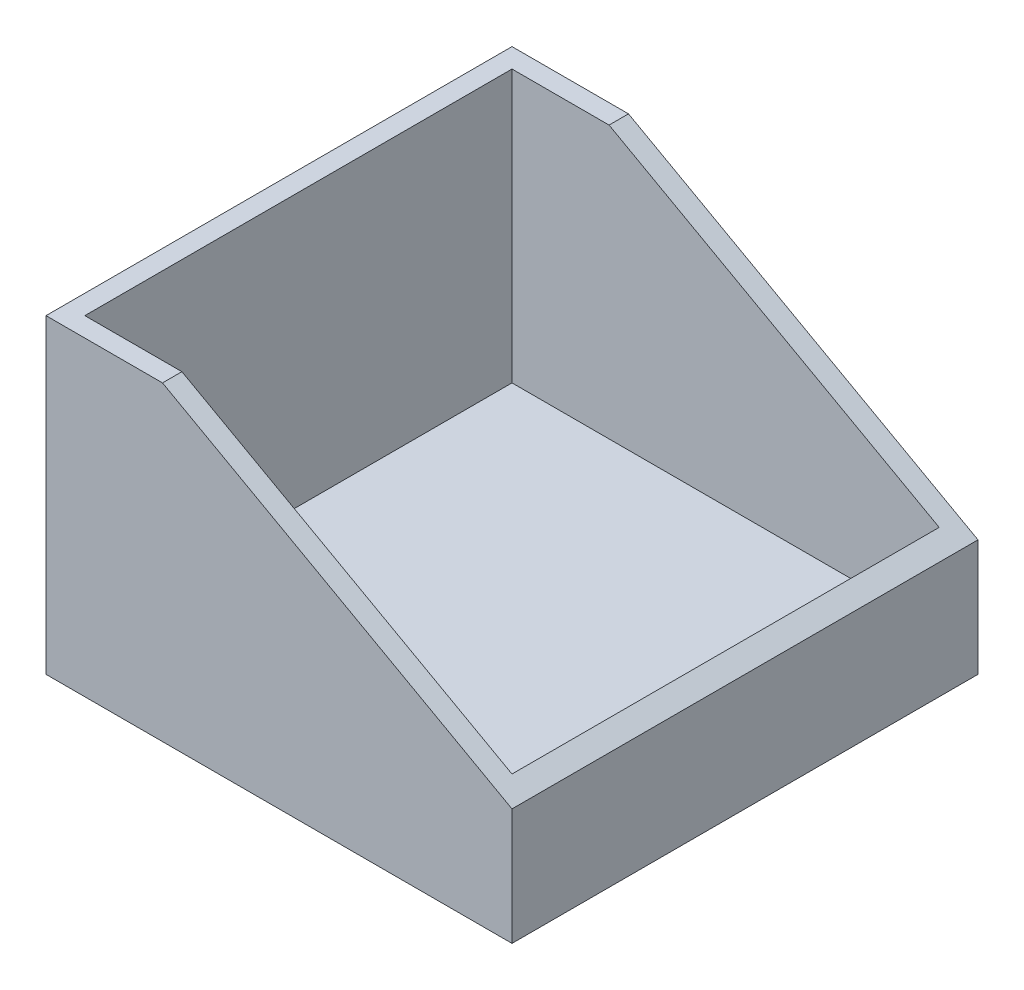
ISO-10303-21;
HEADER;
FILE_DESCRIPTION(('STEP AP214'),'2;1');
FILE_NAME('part.step','',(''),(''),'','','');
FILE_SCHEMA(('AUTOMOTIVE_DESIGN { 1 0 10303 214 1 1 1 1 }'));
ENDSEC;
DATA;
#1=APPLICATION_CONTEXT('core data for automotive mechanical design processes');
#2=APPLICATION_PROTOCOL_DEFINITION('international standard','automotive_design',2000,#1);
#3=PRODUCT_CONTEXT('',#1,'mechanical');
#4=PRODUCT('Part','Part','',(#3));
#5=PRODUCT_RELATED_PRODUCT_CATEGORY('part','',(#4));
#6=PRODUCT_DEFINITION_FORMATION('','',#4);
#7=PRODUCT_DEFINITION_CONTEXT('part definition',#1,'design');
#8=PRODUCT_DEFINITION('design','',#6,#7);
#9=PRODUCT_DEFINITION_SHAPE('','',#8);
#10=(LENGTH_UNIT() NAMED_UNIT(*) SI_UNIT(.MILLI.,.METRE.));
#11=(NAMED_UNIT(*) PLANE_ANGLE_UNIT() SI_UNIT($,.RADIAN.));
#12=(NAMED_UNIT(*) SI_UNIT($,.STERADIAN.) SOLID_ANGLE_UNIT());
#13=UNCERTAINTY_MEASURE_WITH_UNIT(LENGTH_MEASURE(1.E-05),#10,'distance_accuracy_value','');
#14=(GEOMETRIC_REPRESENTATION_CONTEXT(3) GLOBAL_UNCERTAINTY_ASSIGNED_CONTEXT((#13)) GLOBAL_UNIT_ASSIGNED_CONTEXT((#10,
#11,#12)) REPRESENTATION_CONTEXT('',''));
#15=CARTESIAN_POINT('',(0.,0.,0.));
#16=DIRECTION('',(0.,0.,1.));
#17=DIRECTION('',(1.,0.,0.));
#18=AXIS2_PLACEMENT_3D('',#15,#16,#17);
#19=CARTESIAN_POINT('',(152.4,101.6,152.4));
#20=DIRECTION('',(-1.,0.,0.));
#21=DIRECTION('',(0.,0.,1.));
#22=AXIS2_PLACEMENT_3D('',#19,#20,#21);
#23=PLANE('',#22);
#24=DIRECTION('',(0.,0.,1.));
#25=VECTOR('',#24,1.);
#26=CARTESIAN_POINT('',(152.4,38.1,0.));
#27=LINE('',#26,#25);
#28=CARTESIAN_POINT('',(152.4,38.1,0.));
#29=VERTEX_POINT('',#28);
#30=CARTESIAN_POINT('',(152.4,38.1,152.4));
#31=VERTEX_POINT('',#30);
#32=EDGE_CURVE('E56',#29,#31,#27,.T.);
#33=ORIENTED_EDGE('',*,*,#32,.T.);
#34=DIRECTION('',(0.,1.,0.));
#35=VECTOR('',#34,1.);
#36=CARTESIAN_POINT('',(152.4,101.6,152.4));
#37=LINE('',#36,#35);
#38=CARTESIAN_POINT('',(152.4,0.,152.4));
#39=VERTEX_POINT('',#38);
#40=EDGE_CURVE('E162',#39,#31,#37,.T.);
#41=ORIENTED_EDGE('',*,*,#40,.F.);
#42=DIRECTION('',(0.,0.,-1.));
#43=VECTOR('',#42,1.);
#44=CARTESIAN_POINT('',(152.4,0.,152.4));
#45=LINE('',#44,#43);
#46=CARTESIAN_POINT('',(152.4,0.,0.));
#47=VERTEX_POINT('',#46);
#48=EDGE_CURVE('E184',#39,#47,#45,.T.);
#49=ORIENTED_EDGE('',*,*,#48,.T.);
#50=DIRECTION('',(0.,1.,0.));
#51=VECTOR('',#50,1.);
#52=CARTESIAN_POINT('',(152.4,101.6,0.));
#53=LINE('',#52,#51);
#54=EDGE_CURVE('E173',#47,#29,#53,.T.);
#55=ORIENTED_EDGE('',*,*,#54,.T.);
#56=EDGE_LOOP('',(#33,#41,#49,#55));
#57=FACE_BOUND('',#56,.T.);
#58=ADVANCED_FACE('F33',(#57),#23,.F.);
#59=CARTESIAN_POINT('',(0.,101.6,152.4));
#60=DIRECTION('',(0.,-1.,0.));
#61=DIRECTION('',(0.,0.,-1.));
#62=AXIS2_PLACEMENT_3D('',#59,#60,#61);
#63=PLANE('',#62);
#64=DIRECTION('',(0.,0.,1.));
#65=VECTOR('',#64,1.);
#66=CARTESIAN_POINT('',(6.34999999999999,101.6,6.35000000000002));
#67=LINE('',#66,#65);
#68=CARTESIAN_POINT('',(6.34999999999999,101.6,6.35000000000002));
#69=VERTEX_POINT('',#68);
#70=CARTESIAN_POINT('',(6.35000000000002,101.6,146.05));
#71=VERTEX_POINT('',#70);
#72=EDGE_CURVE('E135',#69,#71,#67,.T.);
#73=ORIENTED_EDGE('',*,*,#72,.F.);
#74=DIRECTION('',(-1.,0.,0.));
#75=VECTOR('',#74,1.);
#76=CARTESIAN_POINT('',(146.05,101.6,6.35));
#77=LINE('',#76,#75);
#78=CARTESIAN_POINT('',(38.1000000000001,101.6,6.35000000000001));
#79=VERTEX_POINT('',#78);
#80=EDGE_CURVE('E117',#79,#69,#77,.T.);
#81=ORIENTED_EDGE('',*,*,#80,.F.);
#82=DIRECTION('',(0.,0.,1.));
#83=VECTOR('',#82,1.);
#84=CARTESIAN_POINT('',(38.1,101.6,0.));
#85=LINE('',#84,#83);
#86=CARTESIAN_POINT('',(38.1,101.6,0.));
#87=VERTEX_POINT('',#86);
#88=EDGE_CURVE('E153',#87,#79,#85,.T.);
#89=ORIENTED_EDGE('',*,*,#88,.F.);
#90=DIRECTION('',(-1.,0.,0.));
#91=VECTOR('',#90,1.);
#92=CARTESIAN_POINT('',(0.,101.6,0.));
#93=LINE('',#92,#91);
#94=CARTESIAN_POINT('',(0.,101.6,0.));
#95=VERTEX_POINT('',#94);
#96=EDGE_CURVE('E176',#87,#95,#93,.T.);
#97=ORIENTED_EDGE('',*,*,#96,.T.);
#98=DIRECTION('',(0.,0.,-1.));
#99=VECTOR('',#98,1.);
#100=CARTESIAN_POINT('',(0.,101.6,152.4));
#101=LINE('',#100,#99);
#102=CARTESIAN_POINT('',(0.,101.6,152.4));
#103=VERTEX_POINT('',#102);
#104=EDGE_CURVE('E181',#103,#95,#101,.T.);
#105=ORIENTED_EDGE('',*,*,#104,.F.);
#106=DIRECTION('',(-1.,0.,0.));
#107=VECTOR('',#106,1.);
#108=CARTESIAN_POINT('',(0.,101.6,152.4));
#109=LINE('',#108,#107);
#110=CARTESIAN_POINT('',(38.1,101.6,152.4));
#111=VERTEX_POINT('',#110);
#112=EDGE_CURVE('E166',#111,#103,#109,.T.);
#113=ORIENTED_EDGE('',*,*,#112,.F.);
#114=CARTESIAN_POINT('',(38.1,101.6,146.05));
#115=VERTEX_POINT('',#114);
#116=EDGE_CURVE('E157',#115,#111,#85,.T.);
#117=ORIENTED_EDGE('',*,*,#116,.F.);
#118=DIRECTION('',(1.,0.,0.));
#119=VECTOR('',#118,1.);
#120=CARTESIAN_POINT('',(6.35000000000002,101.6,146.05));
#121=LINE('',#120,#119);
#122=EDGE_CURVE('E48',#71,#115,#121,.T.);
#123=ORIENTED_EDGE('',*,*,#122,.F.);
#124=EDGE_LOOP('',(#73,#81,#89,#97,#105,#113,#117,#123));
#125=FACE_BOUND('',#124,.T.);
#126=ADVANCED_FACE('F196',(#125),#63,.F.);
#127=CARTESIAN_POINT('',(0.,0.,152.4));
#128=DIRECTION('',(0.,0.,-1.));
#129=DIRECTION('',(-1.,0.,0.));
#130=AXIS2_PLACEMENT_3D('',#127,#128,#129);
#131=PLANE('',#130);
#132=DIRECTION('',(-0.874157276121538,0.485642931178632,0.));
#133=VECTOR('',#132,1.);
#134=CARTESIAN_POINT('',(52.1179245283019,93.8122641509434,152.4));
#135=LINE('',#134,#133);
#136=EDGE_CURVE('E144',#31,#111,#135,.T.);
#137=ORIENTED_EDGE('',*,*,#136,.T.);
#138=ORIENTED_EDGE('',*,*,#112,.T.);
#139=DIRECTION('',(0.,-1.,0.));
#140=VECTOR('',#139,1.);
#141=CARTESIAN_POINT('',(0.,0.,152.4));
#142=LINE('',#141,#140);
#143=CARTESIAN_POINT('',(0.,0.,152.4));
#144=VERTEX_POINT('',#143);
#145=EDGE_CURVE('E168',#103,#144,#142,.T.);
#146=ORIENTED_EDGE('',*,*,#145,.T.);
#147=DIRECTION('',(1.,0.,0.));
#148=VECTOR('',#147,1.);
#149=CARTESIAN_POINT('',(152.4,0.,152.4));
#150=LINE('',#149,#148);
#151=EDGE_CURVE('E159',#144,#39,#150,.T.);
#152=ORIENTED_EDGE('',*,*,#151,.T.);
#153=ORIENTED_EDGE('',*,*,#40,.T.);
#154=EDGE_LOOP('',(#137,#138,#146,#152,#153));
#155=FACE_BOUND('',#154,.T.);
#156=ADVANCED_FACE('F210',(#155),#131,.F.);
#157=CARTESIAN_POINT('',(0.,0.,0.));
#158=DIRECTION('',(0.,0.,-1.));
#159=DIRECTION('',(-1.,0.,0.));
#160=AXIS2_PLACEMENT_3D('',#157,#158,#159);
#161=PLANE('',#160);
#162=ORIENTED_EDGE('',*,*,#96,.F.);
#163=DIRECTION('',(-0.874157276121538,0.485642931178632,0.));
#164=VECTOR('',#163,1.);
#165=CARTESIAN_POINT('',(52.1179245283019,93.8122641509434,0.));
#166=LINE('',#165,#164);
#167=EDGE_CURVE('E149',#29,#87,#166,.T.);
#168=ORIENTED_EDGE('',*,*,#167,.F.);
#169=ORIENTED_EDGE('',*,*,#54,.F.);
#170=DIRECTION('',(1.,0.,0.));
#171=VECTOR('',#170,1.);
#172=CARTESIAN_POINT('',(152.4,0.,0.));
#173=LINE('',#172,#171);
#174=CARTESIAN_POINT('',(0.,0.,0.));
#175=VERTEX_POINT('',#174);
#176=EDGE_CURVE('E156',#175,#47,#173,.T.);
#177=ORIENTED_EDGE('',*,*,#176,.F.);
#178=DIRECTION('',(0.,-1.,0.));
#179=VECTOR('',#178,1.);
#180=CARTESIAN_POINT('',(0.,0.,0.));
#181=LINE('',#180,#179);
#182=EDGE_CURVE('E163',#95,#175,#181,.T.);
#183=ORIENTED_EDGE('',*,*,#182,.F.);
#184=EDGE_LOOP('',(#162,#168,#169,#177,#183));
#185=FACE_BOUND('',#184,.T.);
#186=ADVANCED_FACE('F200',(#185),#161,.T.);
#187=CARTESIAN_POINT('',(152.4,0.,152.4));
#188=DIRECTION('',(0.,1.,0.));
#189=DIRECTION('',(-1.,0.,0.));
#190=AXIS2_PLACEMENT_3D('',#187,#188,#189);
#191=PLANE('',#190);
#192=ORIENTED_EDGE('',*,*,#176,.T.);
#193=ORIENTED_EDGE('',*,*,#48,.F.);
#194=ORIENTED_EDGE('',*,*,#151,.F.);
#195=DIRECTION('',(0.,0.,-1.));
#196=VECTOR('',#195,1.);
#197=CARTESIAN_POINT('',(0.,0.,152.4));
#198=LINE('',#197,#196);
#199=EDGE_CURVE('E170',#144,#175,#198,.T.);
#200=ORIENTED_EDGE('',*,*,#199,.T.);
#201=EDGE_LOOP('',(#192,#193,#194,#200));
#202=FACE_BOUND('',#201,.T.);
#203=ADVANCED_FACE('F35',(#202),#191,.F.);
#204=CARTESIAN_POINT('',(0.,0.,152.4));
#205=DIRECTION('',(1.,0.,0.));
#206=DIRECTION('',(0.,0.,-1.));
#207=AXIS2_PLACEMENT_3D('',#204,#205,#206);
#208=PLANE('',#207);
#209=ORIENTED_EDGE('',*,*,#182,.T.);
#210=ORIENTED_EDGE('',*,*,#199,.F.);
#211=ORIENTED_EDGE('',*,*,#145,.F.);
#212=ORIENTED_EDGE('',*,*,#104,.T.);
#213=EDGE_LOOP('',(#209,#210,#211,#212));
#214=FACE_BOUND('',#213,.T.);
#215=ADVANCED_FACE('F204',(#214),#208,.F.);
#216=CARTESIAN_POINT('',(52.1179245283019,93.8122641509434,0.));
#217=DIRECTION('',(0.485642931178632,0.874157276121538,0.));
#218=DIRECTION('',(-0.874157276121538,0.485642931178632,0.));
#219=AXIS2_PLACEMENT_3D('',#216,#217,#218);
#220=PLANE('',#219);
#221=DIRECTION('',(-0.874157276121538,0.485642931178632,0.));
#222=VECTOR('',#221,1.);
#223=CARTESIAN_POINT('',(52.1179245283019,93.8122641509434,6.35000000000001));
#224=LINE('',#223,#222);
#225=CARTESIAN_POINT('',(146.05,41.6277777777778,6.35));
#226=VERTEX_POINT('',#225);
#227=EDGE_CURVE('E11',#226,#79,#224,.T.);
#228=ORIENTED_EDGE('',*,*,#227,.F.);
#229=DIRECTION('',(0.,0.,-1.));
#230=VECTOR('',#229,1.);
#231=CARTESIAN_POINT('',(146.05,41.6277777777778,0.));
#232=LINE('',#231,#230);
#233=CARTESIAN_POINT('',(146.05,41.6277777777778,146.05));
#234=VERTEX_POINT('',#233);
#235=EDGE_CURVE('E41',#234,#226,#232,.T.);
#236=ORIENTED_EDGE('',*,*,#235,.F.);
#237=DIRECTION('',(0.874157276121538,-0.485642931178632,0.));
#238=VECTOR('',#237,1.);
#239=CARTESIAN_POINT('',(52.1179245283019,93.8122641509434,146.05));
#240=LINE('',#239,#238);
#241=EDGE_CURVE('E187',#115,#234,#240,.T.);
#242=ORIENTED_EDGE('',*,*,#241,.F.);
#243=ORIENTED_EDGE('',*,*,#116,.T.);
#244=ORIENTED_EDGE('',*,*,#136,.F.);
#245=ORIENTED_EDGE('',*,*,#32,.F.);
#246=ORIENTED_EDGE('',*,*,#167,.T.);
#247=ORIENTED_EDGE('',*,*,#88,.T.);
#248=EDGE_LOOP('',(#228,#236,#242,#243,#244,#245,#246,#247));
#249=FACE_BOUND('',#248,.T.);
#250=ADVANCED_FACE('F192',(#249),#220,.T.);
#251=CARTESIAN_POINT('',(146.05,12.7,6.35));
#252=DIRECTION('',(0.,0.,-1.));
#253=DIRECTION('',(-1.,0.,0.));
#254=AXIS2_PLACEMENT_3D('',#251,#252,#253);
#255=PLANE('',#254);
#256=ORIENTED_EDGE('',*,*,#227,.T.);
#257=ORIENTED_EDGE('',*,*,#80,.T.);
#258=DIRECTION('',(0.,1.,0.));
#259=VECTOR('',#258,1.);
#260=CARTESIAN_POINT('',(6.34999999999999,12.7,6.35000000000002));
#261=LINE('',#260,#259);
#262=CARTESIAN_POINT('',(6.34999999999999,12.7,6.35000000000002));
#263=VERTEX_POINT('',#262);
#264=EDGE_CURVE('E109',#263,#69,#261,.T.);
#265=ORIENTED_EDGE('',*,*,#264,.F.);
#266=DIRECTION('',(-1.,0.,0.));
#267=VECTOR('',#266,1.);
#268=CARTESIAN_POINT('',(146.05,12.7,6.35));
#269=LINE('',#268,#267);
#270=CARTESIAN_POINT('',(146.05,12.7,6.35));
#271=VERTEX_POINT('',#270);
#272=EDGE_CURVE('E114',#271,#263,#269,.T.);
#273=ORIENTED_EDGE('',*,*,#272,.F.);
#274=DIRECTION('',(0.,1.,0.));
#275=VECTOR('',#274,1.);
#276=CARTESIAN_POINT('',(146.05,12.7,6.35));
#277=LINE('',#276,#275);
#278=EDGE_CURVE('E142',#271,#226,#277,.T.);
#279=ORIENTED_EDGE('',*,*,#278,.T.);
#280=EDGE_LOOP('',(#256,#257,#265,#273,#279));
#281=FACE_BOUND('',#280,.T.);
#282=ADVANCED_FACE('F111',(#281),#255,.F.);
#283=CARTESIAN_POINT('',(146.05,12.7,146.05));
#284=DIRECTION('',(1.,0.,0.));
#285=DIRECTION('',(0.,0.,-1.));
#286=AXIS2_PLACEMENT_3D('',#283,#284,#285);
#287=PLANE('',#286);
#288=ORIENTED_EDGE('',*,*,#235,.T.);
#289=ORIENTED_EDGE('',*,*,#278,.F.);
#290=DIRECTION('',(0.,0.,-1.));
#291=VECTOR('',#290,1.);
#292=CARTESIAN_POINT('',(146.05,12.7,146.05));
#293=LINE('',#292,#291);
#294=CARTESIAN_POINT('',(146.05,12.7,146.05));
#295=VERTEX_POINT('',#294);
#296=EDGE_CURVE('E122',#295,#271,#293,.T.);
#297=ORIENTED_EDGE('',*,*,#296,.F.);
#298=DIRECTION('',(0.,1.,0.));
#299=VECTOR('',#298,1.);
#300=CARTESIAN_POINT('',(146.05,12.7,146.05));
#301=LINE('',#300,#299);
#302=EDGE_CURVE('E145',#295,#234,#301,.T.);
#303=ORIENTED_EDGE('',*,*,#302,.T.);
#304=EDGE_LOOP('',(#288,#289,#297,#303));
#305=FACE_BOUND('',#304,.T.);
#306=ADVANCED_FACE('F190',(#305),#287,.F.);
#307=CARTESIAN_POINT('',(6.35000000000002,12.7,146.05));
#308=DIRECTION('',(0.,0.,1.));
#309=DIRECTION('',(1.,0.,0.));
#310=AXIS2_PLACEMENT_3D('',#307,#308,#309);
#311=PLANE('',#310);
#312=ORIENTED_EDGE('',*,*,#241,.T.);
#313=ORIENTED_EDGE('',*,*,#302,.F.);
#314=DIRECTION('',(1.,0.,0.));
#315=VECTOR('',#314,1.);
#316=CARTESIAN_POINT('',(6.35000000000002,12.7,146.05));
#317=LINE('',#316,#315);
#318=CARTESIAN_POINT('',(6.35000000000002,12.7,146.05));
#319=VERTEX_POINT('',#318);
#320=EDGE_CURVE('E130',#319,#295,#317,.T.);
#321=ORIENTED_EDGE('',*,*,#320,.F.);
#322=DIRECTION('',(0.,1.,0.));
#323=VECTOR('',#322,1.);
#324=CARTESIAN_POINT('',(6.35000000000002,12.7,146.05));
#325=LINE('',#324,#323);
#326=EDGE_CURVE('E121',#319,#71,#325,.T.);
#327=ORIENTED_EDGE('',*,*,#326,.T.);
#328=ORIENTED_EDGE('',*,*,#122,.T.);
#329=EDGE_LOOP('',(#312,#313,#321,#327,#328));
#330=FACE_BOUND('',#329,.T.);
#331=ADVANCED_FACE('F213',(#330),#311,.F.);
#332=CARTESIAN_POINT('',(6.34999999999999,12.7,6.35000000000002));
#333=DIRECTION('',(-1.,0.,0.));
#334=DIRECTION('',(0.,0.,1.));
#335=AXIS2_PLACEMENT_3D('',#332,#333,#334);
#336=PLANE('',#335);
#337=ORIENTED_EDGE('',*,*,#72,.T.);
#338=ORIENTED_EDGE('',*,*,#326,.F.);
#339=DIRECTION('',(0.,0.,1.));
#340=VECTOR('',#339,1.);
#341=CARTESIAN_POINT('',(6.34999999999999,12.7,6.35000000000002));
#342=LINE('',#341,#340);
#343=EDGE_CURVE('E125',#263,#319,#342,.T.);
#344=ORIENTED_EDGE('',*,*,#343,.F.);
#345=ORIENTED_EDGE('',*,*,#264,.T.);
#346=EDGE_LOOP('',(#337,#338,#344,#345));
#347=FACE_BOUND('',#346,.T.);
#348=ADVANCED_FACE('F126',(#347),#336,.F.);
#349=CARTESIAN_POINT('',(0.,12.7,0.));
#350=DIRECTION('',(0.,1.,0.));
#351=DIRECTION('',(0.,0.,1.));
#352=AXIS2_PLACEMENT_3D('',#349,#350,#351);
#353=PLANE('',#352);
#354=ORIENTED_EDGE('',*,*,#272,.T.);
#355=ORIENTED_EDGE('',*,*,#343,.T.);
#356=ORIENTED_EDGE('',*,*,#320,.T.);
#357=ORIENTED_EDGE('',*,*,#296,.T.);
#358=EDGE_LOOP('',(#354,#355,#356,#357));
#359=FACE_BOUND('',#358,.T.);
#360=ADVANCED_FACE('F132',(#359),#353,.T.);
#361=CLOSED_SHELL('',(#58,#126,#156,#186,#203,#215,#250,#282,#306,#331,#348,#360));
#362=MANIFOLD_SOLID_BREP('B2',#361);
#363=ADVANCED_BREP_SHAPE_REPRESENTATION('',(#18,#362),#14);
#364=SHAPE_DEFINITION_REPRESENTATION(#9,#363);
ENDSEC;
END-ISO-10303-21;
